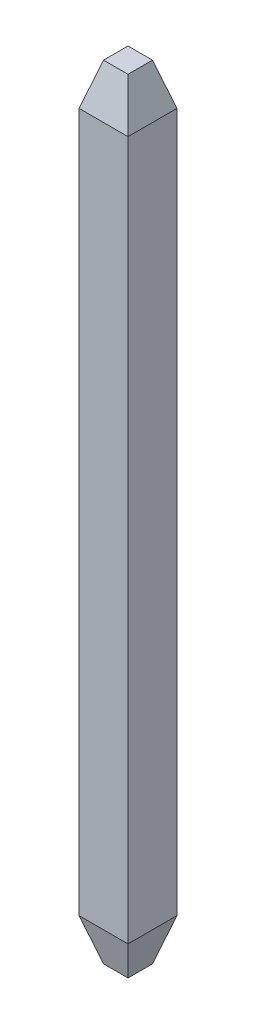
ISO-10303-21;
HEADER;
FILE_DESCRIPTION(('STEP AP214'),'2;1');
FILE_NAME('part.step','',(''),(''),'','','');
FILE_SCHEMA(('AUTOMOTIVE_DESIGN { 1 0 10303 214 1 1 1 1 }'));
ENDSEC;
DATA;
#1=APPLICATION_CONTEXT('core data for automotive mechanical design processes');
#2=APPLICATION_PROTOCOL_DEFINITION('international standard','automotive_design',2000,#1);
#3=PRODUCT_CONTEXT('',#1,'mechanical');
#4=PRODUCT('Part','Part','',(#3));
#5=PRODUCT_RELATED_PRODUCT_CATEGORY('part','',(#4));
#6=PRODUCT_DEFINITION_FORMATION('','',#4);
#7=PRODUCT_DEFINITION_CONTEXT('part definition',#1,'design');
#8=PRODUCT_DEFINITION('design','',#6,#7);
#9=PRODUCT_DEFINITION_SHAPE('','',#8);
#10=(LENGTH_UNIT() NAMED_UNIT(*) SI_UNIT(.MILLI.,.METRE.));
#11=(NAMED_UNIT(*) PLANE_ANGLE_UNIT() SI_UNIT($,.RADIAN.));
#12=(NAMED_UNIT(*) SI_UNIT($,.STERADIAN.) SOLID_ANGLE_UNIT());
#13=UNCERTAINTY_MEASURE_WITH_UNIT(LENGTH_MEASURE(1.E-05),#10,'distance_accuracy_value','');
#14=(GEOMETRIC_REPRESENTATION_CONTEXT(3) GLOBAL_UNCERTAINTY_ASSIGNED_CONTEXT((#13)) GLOBAL_UNIT_ASSIGNED_CONTEXT((#10,
#11,#12)) REPRESENTATION_CONTEXT('',''));
#15=CARTESIAN_POINT('',(0.,0.,0.));
#16=DIRECTION('',(0.,0.,1.));
#17=DIRECTION('',(1.,0.,0.));
#18=AXIS2_PLACEMENT_3D('',#15,#16,#17);
#19=CARTESIAN_POINT('',(-6.18999999998703,-0.965870106912693,-17.2999999999763));
#20=DIRECTION('',(0.,0.281214622974643,-0.959644900900968));
#21=DIRECTION('',(-1.,0.,0.));
#22=AXIS2_PLACEMENT_3D('',#19,#20,#21);
#23=PLANE('',#22);
#24=DIRECTION('',(0.270714017147727,0.923811583516618,0.270714017147727));
#25=VECTOR('',#24,1.);
#26=CARTESIAN_POINT('',(-6.50999999998703,-0.965870106912693,-17.2999999999763));
#27=LINE('',#26,#25);
#28=CARTESIAN_POINT('',(-6.50999999998703,-0.965870106912691,-17.2999999999763));
#29=VERTEX_POINT('',#28);
#30=CARTESIAN_POINT('',(-6.34999999998703,-0.419870106912692,-17.1399999999763));
#31=VERTEX_POINT('',#30);
#32=EDGE_CURVE('E11',#29,#31,#27,.T.);
#33=ORIENTED_EDGE('',*,*,#32,.T.);
#34=DIRECTION('',(1.,0.,0.));
#35=VECTOR('',#34,1.);
#36=CARTESIAN_POINT('',(-6.34999999998703,-0.419870106912693,-17.1399999999763));
#37=LINE('',#36,#35);
#38=CARTESIAN_POINT('',(-6.02999999998704,-0.419870106912692,-17.1399999999763));
#39=VERTEX_POINT('',#38);
#40=EDGE_CURVE('E27',#31,#39,#37,.T.);
#41=ORIENTED_EDGE('',*,*,#40,.T.);
#42=DIRECTION('',(-0.270714017147711,0.923811583516622,0.270714017147728));
#43=VECTOR('',#42,1.);
#44=CARTESIAN_POINT('',(-5.86999999998702,-0.965870106912693,-17.2999999999763));
#45=LINE('',#44,#43);
#46=CARTESIAN_POINT('',(-5.86999999998704,-0.965870106912691,-17.2999999999763));
#47=VERTEX_POINT('',#46);
#48=EDGE_CURVE('E51',#47,#39,#45,.T.);
#49=ORIENTED_EDGE('',*,*,#48,.F.);
#50=DIRECTION('',(1.,0.,0.));
#51=VECTOR('',#50,1.);
#52=CARTESIAN_POINT('',(-6.50999999998703,-0.965870106912693,-17.2999999999763));
#53=LINE('',#52,#51);
#54=EDGE_CURVE('E195',#29,#47,#53,.T.);
#55=ORIENTED_EDGE('',*,*,#54,.F.);
#56=EDGE_LOOP('',(#33,#41,#49,#55));
#57=FACE_BOUND('',#56,.T.);
#58=ADVANCED_FACE('F17',(#57),#23,.T.);
#59=CARTESIAN_POINT('',(-6.50999999998703,-0.965870106912693,-16.9799999999763));
#60=DIRECTION('',(-0.959644900900968,0.281214622974643,0.));
#61=DIRECTION('',(0.,0.,1.));
#62=AXIS2_PLACEMENT_3D('',#59,#60,#61);
#63=PLANE('',#62);
#64=DIRECTION('',(0.270714017147727,0.923811583516618,-0.270714017147727));
#65=VECTOR('',#64,1.);
#66=CARTESIAN_POINT('',(-6.50999999998703,-0.965870106912693,-16.6599999999763));
#67=LINE('',#66,#65);
#68=CARTESIAN_POINT('',(-6.50999999998703,-0.965870106912691,-16.6599999999763));
#69=VERTEX_POINT('',#68);
#70=CARTESIAN_POINT('',(-6.34999999998703,-0.419870106912692,-16.8199999999763));
#71=VERTEX_POINT('',#70);
#72=EDGE_CURVE('E159',#69,#71,#67,.T.);
#73=ORIENTED_EDGE('',*,*,#72,.T.);
#74=DIRECTION('',(0.,0.,-1.));
#75=VECTOR('',#74,1.);
#76=CARTESIAN_POINT('',(-6.34999999998703,-0.419870106912693,-16.8199999999763));
#77=LINE('',#76,#75);
#78=EDGE_CURVE('E155',#71,#31,#77,.T.);
#79=ORIENTED_EDGE('',*,*,#78,.T.);
#80=ORIENTED_EDGE('',*,*,#32,.F.);
#81=DIRECTION('',(0.,0.,-1.));
#82=VECTOR('',#81,1.);
#83=CARTESIAN_POINT('',(-6.50999999998703,-0.965870106912693,-16.6599999999763));
#84=LINE('',#83,#82);
#85=EDGE_CURVE('E118',#69,#29,#84,.T.);
#86=ORIENTED_EDGE('',*,*,#85,.F.);
#87=EDGE_LOOP('',(#73,#79,#80,#86));
#88=FACE_BOUND('',#87,.T.);
#89=ADVANCED_FACE('F280',(#88),#63,.T.);
#90=CARTESIAN_POINT('',(-6.18999999998703,-0.965870106912693,-16.6599999999763));
#91=DIRECTION('',(0.,0.281214622974643,0.959644900900968));
#92=DIRECTION('',(1.,0.,0.));
#93=AXIS2_PLACEMENT_3D('',#90,#91,#92);
#94=PLANE('',#93);
#95=DIRECTION('',(-0.270714017147711,0.923811583516622,-0.270714017147728));
#96=VECTOR('',#95,1.);
#97=CARTESIAN_POINT('',(-5.86999999998702,-0.965870106912693,-16.6599999999763));
#98=LINE('',#97,#96);
#99=CARTESIAN_POINT('',(-5.86999999998704,-0.965870106912691,-16.6599999999763));
#100=VERTEX_POINT('',#99);
#101=CARTESIAN_POINT('',(-6.02999999998704,-0.419870106912692,-16.8199999999763));
#102=VERTEX_POINT('',#101);
#103=EDGE_CURVE('E160',#100,#102,#98,.T.);
#104=ORIENTED_EDGE('',*,*,#103,.T.);
#105=DIRECTION('',(-1.,0.,0.));
#106=VECTOR('',#105,1.);
#107=CARTESIAN_POINT('',(-6.02999999998701,-0.419870106912693,-16.8199999999763));
#108=LINE('',#107,#106);
#109=EDGE_CURVE('E164',#102,#71,#108,.T.);
#110=ORIENTED_EDGE('',*,*,#109,.T.);
#111=ORIENTED_EDGE('',*,*,#72,.F.);
#112=DIRECTION('',(-1.,0.,0.));
#113=VECTOR('',#112,1.);
#114=CARTESIAN_POINT('',(-5.86999999998702,-0.965870106912693,-16.6599999999763));
#115=LINE('',#114,#113);
#116=EDGE_CURVE('E111',#100,#69,#115,.T.);
#117=ORIENTED_EDGE('',*,*,#116,.F.);
#118=EDGE_LOOP('',(#104,#110,#111,#117));
#119=FACE_BOUND('',#118,.T.);
#120=ADVANCED_FACE('F310',(#119),#94,.T.);
#121=CARTESIAN_POINT('',(-6.51099999998701,-5.53543505344795,-16.6599999999763));
#122=DIRECTION('',(0.,0.,1.));
#123=DIRECTION('',(1.,0.,0.));
#124=AXIS2_PLACEMENT_3D('',#121,#122,#123);
#125=PLANE('',#124);
#126=DIRECTION('',(0.,1.,0.));
#127=VECTOR('',#126,1.);
#128=CARTESIAN_POINT('',(-6.50999999998703,-10.1039999999832,-16.6599999999763));
#129=LINE('',#128,#127);
#130=CARTESIAN_POINT('',(-6.50999999998703,-10.1039999999832,-16.6599999999763));
#131=VERTEX_POINT('',#130);
#132=EDGE_CURVE('E106',#131,#69,#129,.T.);
#133=ORIENTED_EDGE('',*,*,#132,.F.);
#134=DIRECTION('',(-1.,0.,0.));
#135=VECTOR('',#134,1.);
#136=CARTESIAN_POINT('',(-5.86999999998702,-10.1039999999832,-16.6599999999763));
#137=LINE('',#136,#135);
#138=CARTESIAN_POINT('',(-5.86999999998704,-10.1039999999832,-16.6599999999763));
#139=VERTEX_POINT('',#138);
#140=EDGE_CURVE('E109',#139,#131,#137,.T.);
#141=ORIENTED_EDGE('',*,*,#140,.F.);
#142=DIRECTION('',(0.,1.,0.));
#143=VECTOR('',#142,1.);
#144=CARTESIAN_POINT('',(-5.86999999998702,-10.1039999999832,-16.6599999999763));
#145=LINE('',#144,#143);
#146=EDGE_CURVE('E161',#139,#100,#145,.T.);
#147=ORIENTED_EDGE('',*,*,#146,.T.);
#148=ORIENTED_EDGE('',*,*,#116,.T.);
#149=EDGE_LOOP('',(#133,#141,#147,#148));
#150=FACE_BOUND('',#149,.T.);
#151=ADVANCED_FACE('F19',(#150),#125,.T.);
#152=CARTESIAN_POINT('',(-5.86999999998702,-11.0738701069127,-16.9799999999763));
#153=DIRECTION('',(1.,0.,0.));
#154=DIRECTION('',(0.,1.,0.));
#155=AXIS2_PLACEMENT_3D('',#152,#153,#154);
#156=PLANE('',#155);
#157=ORIENTED_EDGE('',*,*,#146,.F.);
#158=DIRECTION('',(0.,0.,1.));
#159=VECTOR('',#158,1.);
#160=CARTESIAN_POINT('',(-5.86999999998702,-10.1039999999832,-17.2999999999763));
#161=LINE('',#160,#159);
#162=CARTESIAN_POINT('',(-5.86999999998704,-10.1039999999832,-17.2999999999763));
#163=VERTEX_POINT('',#162);
#164=EDGE_CURVE('E154',#163,#139,#161,.T.);
#165=ORIENTED_EDGE('',*,*,#164,.F.);
#166=DIRECTION('',(0.,1.,0.));
#167=VECTOR('',#166,1.);
#168=CARTESIAN_POINT('',(-5.86999999998702,-10.1039999999832,-17.2999999999763));
#169=LINE('',#168,#167);
#170=EDGE_CURVE('E175',#163,#47,#169,.T.);
#171=ORIENTED_EDGE('',*,*,#170,.T.);
#172=DIRECTION('',(0.,0.,1.));
#173=VECTOR('',#172,1.);
#174=CARTESIAN_POINT('',(-5.86999999998702,-0.965870106912693,-17.2999999999763));
#175=LINE('',#174,#173);
#176=EDGE_CURVE('E178',#47,#100,#175,.T.);
#177=ORIENTED_EDGE('',*,*,#176,.T.);
#178=EDGE_LOOP('',(#157,#165,#171,#177));
#179=FACE_BOUND('',#178,.T.);
#180=ADVANCED_FACE('F226',(#179),#156,.T.);
#181=CARTESIAN_POINT('',(-5.86999999998702,-10.1039999999832,-16.9799999999763));
#182=DIRECTION('',(0.959644900900973,-0.281214622974627,0.));
#183=DIRECTION('',(0.,0.,-1.));
#184=AXIS2_PLACEMENT_3D('',#181,#182,#183);
#185=PLANE('',#184);
#186=ORIENTED_EDGE('',*,*,#164,.T.);
#187=DIRECTION('',(-0.270714017147711,-0.923811583516622,-0.270714017147728));
#188=VECTOR('',#187,1.);
#189=CARTESIAN_POINT('',(-5.86999999998702,-10.1039999999832,-16.6599999999763));
#190=LINE('',#189,#188);
#191=CARTESIAN_POINT('',(-6.02999999998704,-10.6499999999832,-16.8199999999763));
#192=VERTEX_POINT('',#191);
#193=EDGE_CURVE('E127',#139,#192,#190,.T.);
#194=ORIENTED_EDGE('',*,*,#193,.T.);
#195=DIRECTION('',(0.,0.,1.));
#196=VECTOR('',#195,1.);
#197=CARTESIAN_POINT('',(-6.02999999998701,-10.6499999999832,-17.1399999999763));
#198=LINE('',#197,#196);
#199=CARTESIAN_POINT('',(-6.02999999998704,-10.6499999999832,-17.1399999999763));
#200=VERTEX_POINT('',#199);
#201=EDGE_CURVE('E165',#200,#192,#198,.T.);
#202=ORIENTED_EDGE('',*,*,#201,.F.);
#203=DIRECTION('',(-0.270714017147711,-0.923811583516622,0.270714017147728));
#204=VECTOR('',#203,1.);
#205=CARTESIAN_POINT('',(-5.86999999998702,-10.1039999999832,-17.2999999999763));
#206=LINE('',#205,#204);
#207=EDGE_CURVE('E140',#163,#200,#206,.T.);
#208=ORIENTED_EDGE('',*,*,#207,.F.);
#209=EDGE_LOOP('',(#186,#194,#202,#208));
#210=FACE_BOUND('',#209,.T.);
#211=ADVANCED_FACE('F247',(#210),#185,.T.);
#212=CARTESIAN_POINT('',(-6.18999999998703,-10.1039999999832,-17.2999999999763));
#213=DIRECTION('',(0.,-0.281214622974643,-0.959644900900968));
#214=DIRECTION('',(0.,-0.959644900900968,0.281214622974643));
#215=AXIS2_PLACEMENT_3D('',#212,#213,#214);
#216=PLANE('',#215);
#217=DIRECTION('',(1.,0.,0.));
#218=VECTOR('',#217,1.);
#219=CARTESIAN_POINT('',(-6.50999999998703,-10.1039999999832,-17.2999999999763));
#220=LINE('',#219,#218);
#221=CARTESIAN_POINT('',(-6.50999999998703,-10.1039999999832,-17.2999999999763));
#222=VERTEX_POINT('',#221);
#223=EDGE_CURVE('E171',#222,#163,#220,.T.);
#224=ORIENTED_EDGE('',*,*,#223,.T.);
#225=ORIENTED_EDGE('',*,*,#207,.T.);
#226=DIRECTION('',(1.,0.,0.));
#227=VECTOR('',#226,1.);
#228=CARTESIAN_POINT('',(-6.34999999998703,-10.6499999999832,-17.1399999999763));
#229=LINE('',#228,#227);
#230=CARTESIAN_POINT('',(-6.34999999998703,-10.6499999999832,-17.1399999999763));
#231=VERTEX_POINT('',#230);
#232=EDGE_CURVE('E21',#231,#200,#229,.T.);
#233=ORIENTED_EDGE('',*,*,#232,.F.);
#234=DIRECTION('',(0.270714017147727,-0.923811583516618,0.270714017147727));
#235=VECTOR('',#234,1.);
#236=CARTESIAN_POINT('',(-6.50999999998703,-10.1039999999832,-17.2999999999763));
#237=LINE('',#236,#235);
#238=EDGE_CURVE('E141',#222,#231,#237,.T.);
#239=ORIENTED_EDGE('',*,*,#238,.F.);
#240=EDGE_LOOP('',(#224,#225,#233,#239));
#241=FACE_BOUND('',#240,.T.);
#242=ADVANCED_FACE('F243',(#241),#216,.T.);
#243=CARTESIAN_POINT('',(-6.50999999998703,-10.1039999999832,-16.9799999999763));
#244=DIRECTION('',(-0.959644900900968,-0.281214622974643,0.));
#245=DIRECTION('',(-0.281214622974643,0.959644900900968,0.));
#246=AXIS2_PLACEMENT_3D('',#243,#244,#245);
#247=PLANE('',#246);
#248=DIRECTION('',(0.,0.,-1.));
#249=VECTOR('',#248,1.);
#250=CARTESIAN_POINT('',(-6.50999999998703,-10.1039999999832,-16.6599999999763));
#251=LINE('',#250,#249);
#252=EDGE_CURVE('E132',#131,#222,#251,.T.);
#253=ORIENTED_EDGE('',*,*,#252,.T.);
#254=ORIENTED_EDGE('',*,*,#238,.T.);
#255=DIRECTION('',(0.,0.,-1.));
#256=VECTOR('',#255,1.);
#257=CARTESIAN_POINT('',(-6.34999999998703,-10.6499999999832,-16.8199999999763));
#258=LINE('',#257,#256);
#259=CARTESIAN_POINT('',(-6.34999999998703,-10.6499999999832,-16.8199999999763));
#260=VERTEX_POINT('',#259);
#261=EDGE_CURVE('E145',#260,#231,#258,.T.);
#262=ORIENTED_EDGE('',*,*,#261,.F.);
#263=DIRECTION('',(0.270714017147727,-0.923811583516618,-0.270714017147727));
#264=VECTOR('',#263,1.);
#265=CARTESIAN_POINT('',(-6.50999999998703,-10.1039999999832,-16.6599999999763));
#266=LINE('',#265,#264);
#267=EDGE_CURVE('E117',#131,#260,#266,.T.);
#268=ORIENTED_EDGE('',*,*,#267,.F.);
#269=EDGE_LOOP('',(#253,#254,#262,#268));
#270=FACE_BOUND('',#269,.T.);
#271=ADVANCED_FACE('F143',(#270),#247,.T.);
#272=CARTESIAN_POINT('',(-6.35099999998701,-10.6499999999832,-16.9799999999763));
#273=DIRECTION('',(0.,-1.,0.));
#274=DIRECTION('',(0.,0.,-1.));
#275=AXIS2_PLACEMENT_3D('',#272,#273,#274);
#276=PLANE('',#275);
#277=ORIENTED_EDGE('',*,*,#201,.T.);
#278=DIRECTION('',(-1.,0.,0.));
#279=VECTOR('',#278,1.);
#280=CARTESIAN_POINT('',(-6.02999999998701,-10.6499999999832,-16.8199999999763));
#281=LINE('',#280,#279);
#282=EDGE_CURVE('E168',#192,#260,#281,.T.);
#283=ORIENTED_EDGE('',*,*,#282,.T.);
#284=ORIENTED_EDGE('',*,*,#261,.T.);
#285=ORIENTED_EDGE('',*,*,#232,.T.);
#286=EDGE_LOOP('',(#277,#283,#284,#285));
#287=FACE_BOUND('',#286,.T.);
#288=ADVANCED_FACE('F245',(#287),#276,.T.);
#289=CARTESIAN_POINT('',(-6.18999999998703,-10.1039999999832,-16.6599999999763));
#290=DIRECTION('',(0.,-0.281214622974643,0.959644900900968));
#291=DIRECTION('',(-1.,0.,0.));
#292=AXIS2_PLACEMENT_3D('',#289,#290,#291);
#293=PLANE('',#292);
#294=ORIENTED_EDGE('',*,*,#140,.T.);
#295=ORIENTED_EDGE('',*,*,#267,.T.);
#296=ORIENTED_EDGE('',*,*,#282,.F.);
#297=ORIENTED_EDGE('',*,*,#193,.F.);
#298=EDGE_LOOP('',(#294,#295,#296,#297));
#299=FACE_BOUND('',#298,.T.);
#300=ADVANCED_FACE('F122',(#299),#293,.T.);
#301=CARTESIAN_POINT('',(-6.50999999998703,-5.53543505344795,-16.6589999999763));
#302=DIRECTION('',(-1.,0.,0.));
#303=DIRECTION('',(0.,0.,1.));
#304=AXIS2_PLACEMENT_3D('',#301,#302,#303);
#305=PLANE('',#304);
#306=DIRECTION('',(0.,1.,0.));
#307=VECTOR('',#306,1.);
#308=CARTESIAN_POINT('',(-6.50999999998703,-10.1039999999832,-17.2999999999763));
#309=LINE('',#308,#307);
#310=EDGE_CURVE('E135',#222,#29,#309,.T.);
#311=ORIENTED_EDGE('',*,*,#310,.F.);
#312=ORIENTED_EDGE('',*,*,#252,.F.);
#313=ORIENTED_EDGE('',*,*,#132,.T.);
#314=ORIENTED_EDGE('',*,*,#85,.T.);
#315=EDGE_LOOP('',(#311,#312,#313,#314));
#316=FACE_BOUND('',#315,.T.);
#317=ADVANCED_FACE('F133',(#316),#305,.T.);
#318=CARTESIAN_POINT('',(-5.86899999998701,-5.53443505344795,-17.2999999999763));
#319=DIRECTION('',(0.,0.,-1.));
#320=DIRECTION('',(0.,-1.,0.));
#321=AXIS2_PLACEMENT_3D('',#318,#319,#320);
#322=PLANE('',#321);
#323=ORIENTED_EDGE('',*,*,#170,.F.);
#324=ORIENTED_EDGE('',*,*,#223,.F.);
#325=ORIENTED_EDGE('',*,*,#310,.T.);
#326=ORIENTED_EDGE('',*,*,#54,.T.);
#327=EDGE_LOOP('',(#323,#324,#325,#326));
#328=FACE_BOUND('',#327,.T.);
#329=ADVANCED_FACE('F221',(#328),#322,.T.);
#330=CARTESIAN_POINT('',(-5.86999999998702,-0.965870106912693,-16.9799999999763));
#331=DIRECTION('',(0.959644900900973,0.281214622974627,0.));
#332=DIRECTION('',(0.,0.,-1.));
#333=AXIS2_PLACEMENT_3D('',#330,#331,#332);
#334=PLANE('',#333);
#335=ORIENTED_EDGE('',*,*,#48,.T.);
#336=DIRECTION('',(0.,0.,1.));
#337=VECTOR('',#336,1.);
#338=CARTESIAN_POINT('',(-6.02999999998701,-0.419870106912693,-17.1399999999763));
#339=LINE('',#338,#337);
#340=EDGE_CURVE('E185',#39,#102,#339,.T.);
#341=ORIENTED_EDGE('',*,*,#340,.T.);
#342=ORIENTED_EDGE('',*,*,#103,.F.);
#343=ORIENTED_EDGE('',*,*,#176,.F.);
#344=EDGE_LOOP('',(#335,#341,#342,#343));
#345=FACE_BOUND('',#344,.T.);
#346=ADVANCED_FACE('F227',(#345),#334,.T.);
#347=CARTESIAN_POINT('',(-6.18999999998703,-0.419870106912693,-17.1409999999763));
#348=DIRECTION('',(0.,1.,0.));
#349=DIRECTION('',(1.,0.,0.));
#350=AXIS2_PLACEMENT_3D('',#347,#348,#349);
#351=PLANE('',#350);
#352=ORIENTED_EDGE('',*,*,#40,.F.);
#353=ORIENTED_EDGE('',*,*,#78,.F.);
#354=ORIENTED_EDGE('',*,*,#109,.F.);
#355=ORIENTED_EDGE('',*,*,#340,.F.);
#356=EDGE_LOOP('',(#352,#353,#354,#355));
#357=FACE_BOUND('',#356,.T.);
#358=ADVANCED_FACE('F186',(#357),#351,.T.);
#359=CLOSED_SHELL('',(#58,#89,#120,#151,#180,#211,#242,#271,#288,#300,#317,#329,#346,#358));
#360=MANIFOLD_SOLID_BREP('B1',#359);
#361=ADVANCED_BREP_SHAPE_REPRESENTATION('',(#18,#360),#14);
#362=SHAPE_DEFINITION_REPRESENTATION(#9,#361);
ENDSEC;
END-ISO-10303-21;
